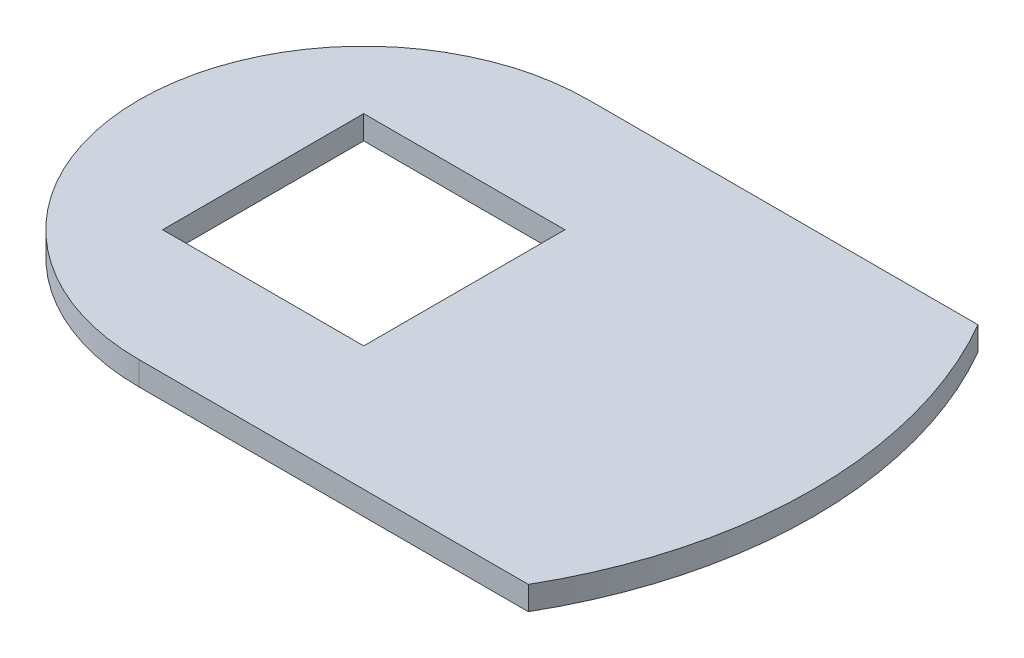
ISO-10303-21;
HEADER;
FILE_DESCRIPTION(('STEP AP214'),'2;1');
FILE_NAME('part.step','',(''),(''),'','','');
FILE_SCHEMA(('AUTOMOTIVE_DESIGN { 1 0 10303 214 1 1 1 1 }'));
ENDSEC;
DATA;
#1=APPLICATION_CONTEXT('core data for automotive mechanical design processes');
#2=APPLICATION_PROTOCOL_DEFINITION('international standard','automotive_design',2000,#1);
#3=PRODUCT_CONTEXT('',#1,'mechanical');
#4=PRODUCT('Part','Part','',(#3));
#5=PRODUCT_RELATED_PRODUCT_CATEGORY('part','',(#4));
#6=PRODUCT_DEFINITION_FORMATION('','',#4);
#7=PRODUCT_DEFINITION_CONTEXT('part definition',#1,'design');
#8=PRODUCT_DEFINITION('design','',#6,#7);
#9=PRODUCT_DEFINITION_SHAPE('','',#8);
#10=(LENGTH_UNIT() NAMED_UNIT(*) SI_UNIT(.MILLI.,.METRE.));
#11=(NAMED_UNIT(*) PLANE_ANGLE_UNIT() SI_UNIT($,.RADIAN.));
#12=(NAMED_UNIT(*) SI_UNIT($,.STERADIAN.) SOLID_ANGLE_UNIT());
#13=UNCERTAINTY_MEASURE_WITH_UNIT(LENGTH_MEASURE(1.E-05),#10,'distance_accuracy_value','');
#14=(GEOMETRIC_REPRESENTATION_CONTEXT(3) GLOBAL_UNCERTAINTY_ASSIGNED_CONTEXT((#13)) GLOBAL_UNIT_ASSIGNED_CONTEXT((#10,
#11,#12)) REPRESENTATION_CONTEXT('',''));
#15=CARTESIAN_POINT('',(0.,0.,0.));
#16=DIRECTION('',(0.,0.,1.));
#17=DIRECTION('',(1.,0.,0.));
#18=AXIS2_PLACEMENT_3D('',#15,#16,#17);
#19=CARTESIAN_POINT('',(0.,1.,9.5));
#20=DIRECTION('',(0.,0.,-1.));
#21=DIRECTION('',(-1.,0.,0.));
#22=AXIS2_PLACEMENT_3D('',#19,#20,#21);
#23=PLANE('',#22);
#24=DIRECTION('',(1.,0.,0.));
#25=VECTOR('',#24,1.);
#26=CARTESIAN_POINT('',(0.,0.,9.5));
#27=LINE('',#26,#25);
#28=CARTESIAN_POINT('',(0.,0.,9.5));
#29=VERTEX_POINT('',#28);
#30=CARTESIAN_POINT('',(16.4544826719043,0.,9.5));
#31=VERTEX_POINT('',#30);
#32=EDGE_CURVE('E154',#29,#31,#27,.T.);
#33=ORIENTED_EDGE('',*,*,#32,.T.);
#34=DIRECTION('',(0.,-1.,0.));
#35=VECTOR('',#34,1.);
#36=CARTESIAN_POINT('',(16.4544826719043,1.,9.5));
#37=LINE('',#36,#35);
#38=CARTESIAN_POINT('',(16.4544826719043,1.,9.5));
#39=VERTEX_POINT('',#38);
#40=EDGE_CURVE('E11',#39,#31,#37,.T.);
#41=ORIENTED_EDGE('',*,*,#40,.F.);
#42=DIRECTION('',(1.,0.,0.));
#43=VECTOR('',#42,1.);
#44=CARTESIAN_POINT('',(0.,1.,9.5));
#45=LINE('',#44,#43);
#46=CARTESIAN_POINT('',(0.,1.,9.5));
#47=VERTEX_POINT('',#46);
#48=EDGE_CURVE('E121',#47,#39,#45,.T.);
#49=ORIENTED_EDGE('',*,*,#48,.F.);
#50=DIRECTION('',(0.,-1.,0.));
#51=VECTOR('',#50,1.);
#52=CARTESIAN_POINT('',(0.,1.,9.5));
#53=LINE('',#52,#51);
#54=EDGE_CURVE('E163',#47,#29,#53,.T.);
#55=ORIENTED_EDGE('',*,*,#54,.T.);
#56=EDGE_LOOP('',(#33,#41,#49,#55));
#57=FACE_BOUND('',#56,.T.);
#58=ADVANCED_FACE('F41',(#57),#23,.F.);
#59=CARTESIAN_POINT('',(0.,1.,0.));
#60=DIRECTION('',(0.,-1.,0.));
#61=DIRECTION('',(0.,0.,-1.));
#62=AXIS2_PLACEMENT_3D('',#59,#60,#61);
#63=CYLINDRICAL_SURFACE('',#62,19.);
#64=CARTESIAN_POINT('',(0.,0.,0.));
#65=DIRECTION('',(0.,1.,0.));
#66=DIRECTION('',(0.,0.,1.));
#67=AXIS2_PLACEMENT_3D('',#64,#65,#66);
#68=CIRCLE('',#67,19.);
#69=CARTESIAN_POINT('',(16.4544826719043,0.,-9.5));
#70=VERTEX_POINT('',#69);
#71=EDGE_CURVE('E128',#31,#70,#68,.T.);
#72=ORIENTED_EDGE('',*,*,#71,.T.);
#73=DIRECTION('',(0.,-1.,0.));
#74=VECTOR('',#73,1.);
#75=CARTESIAN_POINT('',(16.4544826719043,1.,-9.5));
#76=LINE('',#75,#74);
#77=CARTESIAN_POINT('',(16.4544826719043,1.,-9.5));
#78=VERTEX_POINT('',#77);
#79=EDGE_CURVE('E51',#78,#70,#76,.T.);
#80=ORIENTED_EDGE('',*,*,#79,.F.);
#81=CARTESIAN_POINT('',(0.,1.,0.));
#82=DIRECTION('',(0.,1.,0.));
#83=DIRECTION('',(0.,0.,1.));
#84=AXIS2_PLACEMENT_3D('',#81,#82,#83);
#85=CIRCLE('',#84,19.);
#86=EDGE_CURVE('E115',#39,#78,#85,.T.);
#87=ORIENTED_EDGE('',*,*,#86,.F.);
#88=ORIENTED_EDGE('',*,*,#40,.T.);
#89=EDGE_LOOP('',(#72,#80,#87,#88));
#90=FACE_BOUND('',#89,.T.);
#91=ADVANCED_FACE('F127',(#90),#63,.T.);
#92=CARTESIAN_POINT('',(0.,1.,-9.5));
#93=DIRECTION('',(0.,0.,-1.));
#94=DIRECTION('',(-1.,0.,0.));
#95=AXIS2_PLACEMENT_3D('',#92,#93,#94);
#96=PLANE('',#95);
#97=DIRECTION('',(1.,0.,0.));
#98=VECTOR('',#97,1.);
#99=CARTESIAN_POINT('',(0.,0.,-9.5));
#100=LINE('',#99,#98);
#101=CARTESIAN_POINT('',(0.,0.,-9.5));
#102=VERTEX_POINT('',#101);
#103=EDGE_CURVE('E159',#102,#70,#100,.T.);
#104=ORIENTED_EDGE('',*,*,#103,.F.);
#105=DIRECTION('',(0.,-1.,0.));
#106=VECTOR('',#105,1.);
#107=CARTESIAN_POINT('',(0.,1.,-9.5));
#108=LINE('',#107,#106);
#109=CARTESIAN_POINT('',(0.,1.,-9.5));
#110=VERTEX_POINT('',#109);
#111=EDGE_CURVE('E89',#110,#102,#108,.T.);
#112=ORIENTED_EDGE('',*,*,#111,.F.);
#113=DIRECTION('',(1.,0.,0.));
#114=VECTOR('',#113,1.);
#115=CARTESIAN_POINT('',(0.,1.,-9.5));
#116=LINE('',#115,#114);
#117=EDGE_CURVE('E119',#110,#78,#116,.T.);
#118=ORIENTED_EDGE('',*,*,#117,.T.);
#119=ORIENTED_EDGE('',*,*,#79,.T.);
#120=EDGE_LOOP('',(#104,#112,#118,#119));
#121=FACE_BOUND('',#120,.T.);
#122=ADVANCED_FACE('F134',(#121),#96,.T.);
#123=CARTESIAN_POINT('',(0.,1.,-4.25));
#124=DIRECTION('',(0.,0.,-1.));
#125=DIRECTION('',(-1.,0.,0.));
#126=AXIS2_PLACEMENT_3D('',#123,#124,#125);
#127=PLANE('',#126);
#128=DIRECTION('',(1.,0.,0.));
#129=VECTOR('',#128,1.);
#130=CARTESIAN_POINT('',(0.,0.,-4.25));
#131=LINE('',#130,#129);
#132=CARTESIAN_POINT('',(-4.25,0.,-4.25));
#133=VERTEX_POINT('',#132);
#134=CARTESIAN_POINT('',(4.25,0.,-4.25));
#135=VERTEX_POINT('',#134);
#136=EDGE_CURVE('E142',#133,#135,#131,.T.);
#137=ORIENTED_EDGE('',*,*,#136,.T.);
#138=DIRECTION('',(0.,-1.,0.));
#139=VECTOR('',#138,1.);
#140=CARTESIAN_POINT('',(4.25,1.,-4.25));
#141=LINE('',#140,#139);
#142=CARTESIAN_POINT('',(4.25,1.,-4.25));
#143=VERTEX_POINT('',#142);
#144=EDGE_CURVE('E45',#143,#135,#141,.T.);
#145=ORIENTED_EDGE('',*,*,#144,.F.);
#146=DIRECTION('',(1.,0.,0.));
#147=VECTOR('',#146,1.);
#148=CARTESIAN_POINT('',(0.,1.,-4.25));
#149=LINE('',#148,#147);
#150=CARTESIAN_POINT('',(-4.25,1.,-4.25));
#151=VERTEX_POINT('',#150);
#152=EDGE_CURVE('E162',#151,#143,#149,.T.);
#153=ORIENTED_EDGE('',*,*,#152,.F.);
#154=DIRECTION('',(0.,-1.,0.));
#155=VECTOR('',#154,1.);
#156=CARTESIAN_POINT('',(-4.25,1.,-4.25));
#157=LINE('',#156,#155);
#158=EDGE_CURVE('E138',#151,#133,#157,.T.);
#159=ORIENTED_EDGE('',*,*,#158,.T.);
#160=EDGE_LOOP('',(#137,#145,#153,#159));
#161=FACE_BOUND('',#160,.T.);
#162=ADVANCED_FACE('F43',(#161),#127,.F.);
#163=CARTESIAN_POINT('',(4.25,1.,0.));
#164=DIRECTION('',(1.,0.,0.));
#165=DIRECTION('',(0.,0.,-1.));
#166=AXIS2_PLACEMENT_3D('',#163,#164,#165);
#167=PLANE('',#166);
#168=DIRECTION('',(0.,0.,1.));
#169=VECTOR('',#168,1.);
#170=CARTESIAN_POINT('',(4.25,0.,0.));
#171=LINE('',#170,#169);
#172=CARTESIAN_POINT('',(4.25,0.,4.25));
#173=VERTEX_POINT('',#172);
#174=EDGE_CURVE('E145',#135,#173,#171,.T.);
#175=ORIENTED_EDGE('',*,*,#174,.T.);
#176=DIRECTION('',(0.,-1.,0.));
#177=VECTOR('',#176,1.);
#178=CARTESIAN_POINT('',(4.25,1.,4.25));
#179=LINE('',#178,#177);
#180=CARTESIAN_POINT('',(4.25,1.,4.25));
#181=VERTEX_POINT('',#180);
#182=EDGE_CURVE('E168',#181,#173,#179,.T.);
#183=ORIENTED_EDGE('',*,*,#182,.F.);
#184=DIRECTION('',(0.,0.,1.));
#185=VECTOR('',#184,1.);
#186=CARTESIAN_POINT('',(4.25,1.,0.));
#187=LINE('',#186,#185);
#188=EDGE_CURVE('E101',#143,#181,#187,.T.);
#189=ORIENTED_EDGE('',*,*,#188,.F.);
#190=ORIENTED_EDGE('',*,*,#144,.T.);
#191=EDGE_LOOP('',(#175,#183,#189,#190));
#192=FACE_BOUND('',#191,.T.);
#193=ADVANCED_FACE('F173',(#192),#167,.F.);
#194=CARTESIAN_POINT('',(0.,1.,4.25));
#195=DIRECTION('',(0.,0.,-1.));
#196=DIRECTION('',(-1.,0.,0.));
#197=AXIS2_PLACEMENT_3D('',#194,#195,#196);
#198=PLANE('',#197);
#199=DIRECTION('',(1.,0.,0.));
#200=VECTOR('',#199,1.);
#201=CARTESIAN_POINT('',(0.,0.,4.25));
#202=LINE('',#201,#200);
#203=CARTESIAN_POINT('',(-4.25,0.,4.25));
#204=VERTEX_POINT('',#203);
#205=EDGE_CURVE('E148',#204,#173,#202,.T.);
#206=ORIENTED_EDGE('',*,*,#205,.F.);
#207=DIRECTION('',(0.,-1.,0.));
#208=VECTOR('',#207,1.);
#209=CARTESIAN_POINT('',(-4.25,1.,4.25));
#210=LINE('',#209,#208);
#211=CARTESIAN_POINT('',(-4.25,1.,4.25));
#212=VERTEX_POINT('',#211);
#213=EDGE_CURVE('E167',#212,#204,#210,.T.);
#214=ORIENTED_EDGE('',*,*,#213,.F.);
#215=DIRECTION('',(1.,0.,0.));
#216=VECTOR('',#215,1.);
#217=CARTESIAN_POINT('',(0.,1.,4.25));
#218=LINE('',#217,#216);
#219=EDGE_CURVE('E215',#212,#181,#218,.T.);
#220=ORIENTED_EDGE('',*,*,#219,.T.);
#221=ORIENTED_EDGE('',*,*,#182,.T.);
#222=EDGE_LOOP('',(#206,#214,#220,#221));
#223=FACE_BOUND('',#222,.T.);
#224=ADVANCED_FACE('F187',(#223),#198,.T.);
#225=CARTESIAN_POINT('',(-4.25,1.,0.));
#226=DIRECTION('',(1.,0.,0.));
#227=DIRECTION('',(0.,0.,-1.));
#228=AXIS2_PLACEMENT_3D('',#225,#226,#227);
#229=PLANE('',#228);
#230=DIRECTION('',(0.,0.,1.));
#231=VECTOR('',#230,1.);
#232=CARTESIAN_POINT('',(-4.25,0.,0.));
#233=LINE('',#232,#231);
#234=EDGE_CURVE('E151',#133,#204,#233,.T.);
#235=ORIENTED_EDGE('',*,*,#234,.F.);
#236=ORIENTED_EDGE('',*,*,#158,.F.);
#237=DIRECTION('',(0.,0.,1.));
#238=VECTOR('',#237,1.);
#239=CARTESIAN_POINT('',(-4.25,1.,0.));
#240=LINE('',#239,#238);
#241=EDGE_CURVE('E185',#151,#212,#240,.T.);
#242=ORIENTED_EDGE('',*,*,#241,.T.);
#243=ORIENTED_EDGE('',*,*,#213,.T.);
#244=EDGE_LOOP('',(#235,#236,#242,#243));
#245=FACE_BOUND('',#244,.T.);
#246=ADVANCED_FACE('F182',(#245),#229,.T.);
#247=CARTESIAN_POINT('',(0.,1.,0.));
#248=DIRECTION('',(0.,-1.,0.));
#249=DIRECTION('',(0.,0.,-1.));
#250=AXIS2_PLACEMENT_3D('',#247,#248,#249);
#251=CYLINDRICAL_SURFACE('',#250,9.5);
#252=CARTESIAN_POINT('',(0.,0.,0.));
#253=DIRECTION('',(0.,1.,0.));
#254=DIRECTION('',(0.,0.,1.));
#255=AXIS2_PLACEMENT_3D('',#252,#253,#254);
#256=CIRCLE('',#255,9.5);
#257=EDGE_CURVE('E92',#102,#29,#256,.T.);
#258=ORIENTED_EDGE('',*,*,#257,.T.);
#259=ORIENTED_EDGE('',*,*,#54,.F.);
#260=CARTESIAN_POINT('',(0.,1.,0.));
#261=DIRECTION('',(0.,1.,0.));
#262=DIRECTION('',(0.,0.,1.));
#263=AXIS2_PLACEMENT_3D('',#260,#261,#262);
#264=CIRCLE('',#263,9.5);
#265=EDGE_CURVE('E60',#110,#47,#264,.T.);
#266=ORIENTED_EDGE('',*,*,#265,.F.);
#267=ORIENTED_EDGE('',*,*,#111,.T.);
#268=EDGE_LOOP('',(#258,#259,#266,#267));
#269=FACE_BOUND('',#268,.T.);
#270=ADVANCED_FACE('F194',(#269),#251,.T.);
#271=CARTESIAN_POINT('',(0.,1.,0.));
#272=DIRECTION('',(0.,1.,0.));
#273=DIRECTION('',(0.,0.,1.));
#274=AXIS2_PLACEMENT_3D('',#271,#272,#273);
#275=PLANE('',#274);
#276=ORIENTED_EDGE('',*,*,#152,.T.);
#277=ORIENTED_EDGE('',*,*,#188,.T.);
#278=ORIENTED_EDGE('',*,*,#219,.F.);
#279=ORIENTED_EDGE('',*,*,#241,.F.);
#280=EDGE_LOOP('',(#276,#277,#278,#279));
#281=FACE_BOUND('',#280,.T.);
#282=ORIENTED_EDGE('',*,*,#48,.T.);
#283=ORIENTED_EDGE('',*,*,#86,.T.);
#284=ORIENTED_EDGE('',*,*,#117,.F.);
#285=ORIENTED_EDGE('',*,*,#265,.T.);
#286=EDGE_LOOP('',(#282,#283,#284,#285));
#287=FACE_BOUND('',#286,.T.);
#288=ADVANCED_FACE('F117',(#281,#287),#275,.T.);
#289=CARTESIAN_POINT('',(0.,0.,0.));
#290=DIRECTION('',(0.,1.,0.));
#291=DIRECTION('',(0.,0.,1.));
#292=AXIS2_PLACEMENT_3D('',#289,#290,#291);
#293=PLANE('',#292);
#294=ORIENTED_EDGE('',*,*,#136,.F.);
#295=ORIENTED_EDGE('',*,*,#234,.T.);
#296=ORIENTED_EDGE('',*,*,#205,.T.);
#297=ORIENTED_EDGE('',*,*,#174,.F.);
#298=EDGE_LOOP('',(#294,#295,#296,#297));
#299=FACE_BOUND('',#298,.T.);
#300=ORIENTED_EDGE('',*,*,#32,.F.);
#301=ORIENTED_EDGE('',*,*,#257,.F.);
#302=ORIENTED_EDGE('',*,*,#103,.T.);
#303=ORIENTED_EDGE('',*,*,#71,.F.);
#304=EDGE_LOOP('',(#300,#301,#302,#303));
#305=FACE_BOUND('',#304,.T.);
#306=ADVANCED_FACE('F179',(#299,#305),#293,.F.);
#307=CLOSED_SHELL('',(#58,#91,#122,#162,#193,#224,#246,#270,#288,#306));
#308=MANIFOLD_SOLID_BREP('B2',#307);
#309=ADVANCED_BREP_SHAPE_REPRESENTATION('',(#18,#308),#14);
#310=SHAPE_DEFINITION_REPRESENTATION(#9,#309);
ENDSEC;
END-ISO-10303-21;
